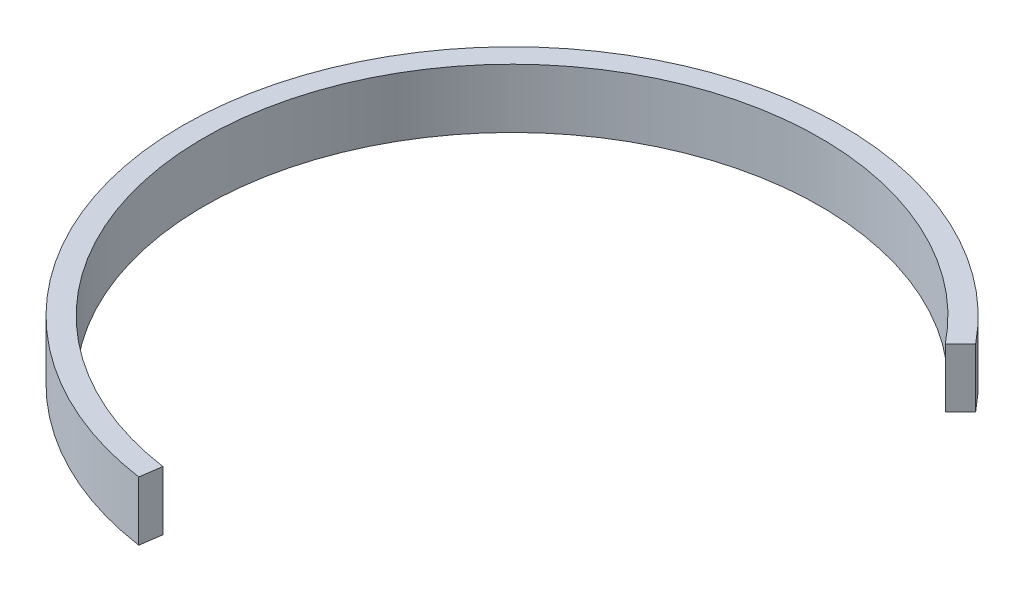
ISO-10303-21;
HEADER;
FILE_DESCRIPTION(('STEP AP214'),'2;1');
FILE_NAME('part.step','',(''),(''),'','','');
FILE_SCHEMA(('AUTOMOTIVE_DESIGN { 1 0 10303 214 1 1 1 1 }'));
ENDSEC;
DATA;
#1=APPLICATION_CONTEXT('core data for automotive mechanical design processes');
#2=APPLICATION_PROTOCOL_DEFINITION('international standard','automotive_design',2000,#1);
#3=PRODUCT_CONTEXT('',#1,'mechanical');
#4=PRODUCT('Part','Part','',(#3));
#5=PRODUCT_RELATED_PRODUCT_CATEGORY('part','',(#4));
#6=PRODUCT_DEFINITION_FORMATION('','',#4);
#7=PRODUCT_DEFINITION_CONTEXT('part definition',#1,'design');
#8=PRODUCT_DEFINITION('design','',#6,#7);
#9=PRODUCT_DEFINITION_SHAPE('','',#8);
#10=(LENGTH_UNIT() NAMED_UNIT(*) SI_UNIT(.MILLI.,.METRE.));
#11=(NAMED_UNIT(*) PLANE_ANGLE_UNIT() SI_UNIT($,.RADIAN.));
#12=(NAMED_UNIT(*) SI_UNIT($,.STERADIAN.) SOLID_ANGLE_UNIT());
#13=UNCERTAINTY_MEASURE_WITH_UNIT(LENGTH_MEASURE(1.E-05),#10,'distance_accuracy_value','');
#14=(GEOMETRIC_REPRESENTATION_CONTEXT(3) GLOBAL_UNCERTAINTY_ASSIGNED_CONTEXT((#13)) GLOBAL_UNIT_ASSIGNED_CONTEXT((#10,
#11,#12)) REPRESENTATION_CONTEXT('',''));
#15=CARTESIAN_POINT('',(0.,0.,0.));
#16=DIRECTION('',(0.,0.,1.));
#17=DIRECTION('',(1.,0.,0.));
#18=AXIS2_PLACEMENT_3D('',#15,#16,#17);
#19=CARTESIAN_POINT('',(145.719440182729,10.,-180.148984957569));
#20=DIRECTION('',(0.,-1.,0.));
#21=DIRECTION('',(0.,0.,-1.));
#22=AXIS2_PLACEMENT_3D('',#19,#20,#21);
#23=CYLINDRICAL_SURFACE('',#22,55.7524444730003);
#24=CARTESIAN_POINT('',(145.719440182729,0.,-180.148984957569));
#25=DIRECTION('',(0.,1.,0.));
#26=DIRECTION('',(0.,0.,1.));
#27=AXIS2_PLACEMENT_3D('',#24,#25,#26);
#28=CIRCLE('',#27,55.7524444730003);
#29=CARTESIAN_POINT('',(189.023006099054,0.,-215.265024649502));
#30=VERTEX_POINT('',#29);
#31=CARTESIAN_POINT('',(137.740061224364,0.,-124.970505673035));
#32=VERTEX_POINT('',#31);
#33=EDGE_CURVE('E93',#30,#32,#28,.T.);
#34=ORIENTED_EDGE('',*,*,#33,.T.);
#35=DIRECTION('',(0.,-1.,0.));
#36=VECTOR('',#35,1.);
#37=CARTESIAN_POINT('',(137.740061224364,10.,-124.970505673035));
#38=LINE('',#37,#36);
#39=CARTESIAN_POINT('',(137.740061224364,10.,-124.970505673035));
#40=VERTEX_POINT('',#39);
#41=EDGE_CURVE('E11',#40,#32,#38,.T.);
#42=ORIENTED_EDGE('',*,*,#41,.F.);
#43=CARTESIAN_POINT('',(145.719440182729,10.,-180.148984957569));
#44=DIRECTION('',(0.,1.,0.));
#45=DIRECTION('',(0.,0.,1.));
#46=AXIS2_PLACEMENT_3D('',#43,#44,#45);
#47=CIRCLE('',#46,55.7524444730003);
#48=CARTESIAN_POINT('',(189.023006099054,10.,-215.265024649502));
#49=VERTEX_POINT('',#48);
#50=EDGE_CURVE('E81',#49,#40,#47,.T.);
#51=ORIENTED_EDGE('',*,*,#50,.F.);
#52=DIRECTION('',(0.,-1.,0.));
#53=VECTOR('',#52,1.);
#54=CARTESIAN_POINT('',(189.023006099054,10.,-215.265024649502));
#55=LINE('',#54,#53);
#56=EDGE_CURVE('E89',#49,#30,#55,.T.);
#57=ORIENTED_EDGE('',*,*,#56,.T.);
#58=EDGE_LOOP('',(#34,#42,#51,#57));
#59=FACE_BOUND('',#58,.T.);
#60=ADVANCED_FACE('F30',(#59),#23,.T.);
#61=CARTESIAN_POINT('',(138.256458041574,10.,-128.541459155716));
#62=DIRECTION('',(-0.98970511169705,0.,-0.143121598232864));
#63=DIRECTION('',(-0.143121598232864,0.,0.98970511169705));
#64=AXIS2_PLACEMENT_3D('',#61,#62,#63);
#65=PLANE('',#64);
#66=DIRECTION('',(0.143121598232864,0.,-0.98970511169705));
#67=VECTOR('',#66,1.);
#68=CARTESIAN_POINT('',(138.256458041574,0.,-128.541459155716));
#69=LINE('',#68,#67);
#70=CARTESIAN_POINT('',(138.256458041574,0.,-128.541459155716));
#71=VERTEX_POINT('',#70);
#72=EDGE_CURVE('E85',#32,#71,#69,.T.);
#73=ORIENTED_EDGE('',*,*,#72,.T.);
#74=DIRECTION('',(0.,-1.,0.));
#75=VECTOR('',#74,1.);
#76=CARTESIAN_POINT('',(138.256458041574,10.,-128.541459155716));
#77=LINE('',#76,#75);
#78=CARTESIAN_POINT('',(138.256458041574,10.,-128.541459155716));
#79=VERTEX_POINT('',#78);
#80=EDGE_CURVE('E38',#79,#71,#77,.T.);
#81=ORIENTED_EDGE('',*,*,#80,.F.);
#82=DIRECTION('',(0.143121598232864,0.,-0.98970511169705));
#83=VECTOR('',#82,1.);
#84=CARTESIAN_POINT('',(138.256458041574,10.,-128.541459155716));
#85=LINE('',#84,#83);
#86=EDGE_CURVE('E76',#40,#79,#85,.T.);
#87=ORIENTED_EDGE('',*,*,#86,.F.);
#88=ORIENTED_EDGE('',*,*,#41,.T.);
#89=EDGE_LOOP('',(#73,#81,#87,#88));
#90=FACE_BOUND('',#89,.T.);
#91=ADVANCED_FACE('F84',(#90),#65,.F.);
#92=CARTESIAN_POINT('',(145.719440182729,10.,-180.148984957569));
#93=DIRECTION('',(0.,-1.,0.));
#94=DIRECTION('',(0.,0.,-1.));
#95=AXIS2_PLACEMENT_3D('',#92,#93,#94);
#96=CYLINDRICAL_SURFACE('',#95,52.1443460197569);
#97=CARTESIAN_POINT('',(145.719440182729,0.,-180.148984957569));
#98=DIRECTION('',(0.,-1.,0.));
#99=DIRECTION('',(0.,0.,1.));
#100=AXIS2_PLACEMENT_3D('',#97,#98,#99);
#101=CIRCLE('',#100,52.1443460197569);
#102=CARTESIAN_POINT('',(186.456859150957,0.,-212.698877701405));
#103=VERTEX_POINT('',#102);
#104=EDGE_CURVE('E63',#71,#103,#101,.T.);
#105=ORIENTED_EDGE('',*,*,#104,.T.);
#106=DIRECTION('',(0.,-1.,0.));
#107=VECTOR('',#106,1.);
#108=CARTESIAN_POINT('',(186.456859150957,10.,-212.698877701405));
#109=LINE('',#108,#107);
#110=CARTESIAN_POINT('',(186.456859150957,10.,-212.698877701405));
#111=VERTEX_POINT('',#110);
#112=EDGE_CURVE('E86',#111,#103,#109,.T.);
#113=ORIENTED_EDGE('',*,*,#112,.F.);
#114=CARTESIAN_POINT('',(145.719440182729,10.,-180.148984957569));
#115=DIRECTION('',(0.,-1.,0.));
#116=DIRECTION('',(0.,0.,1.));
#117=AXIS2_PLACEMENT_3D('',#114,#115,#116);
#118=CIRCLE('',#117,52.1443460197569);
#119=EDGE_CURVE('E79',#79,#111,#118,.T.);
#120=ORIENTED_EDGE('',*,*,#119,.F.);
#121=ORIENTED_EDGE('',*,*,#80,.T.);
#122=EDGE_LOOP('',(#105,#113,#120,#121));
#123=FACE_BOUND('',#122,.T.);
#124=ADVANCED_FACE('F87',(#123),#96,.F.);
#125=CARTESIAN_POINT('',(186.456859150957,10.,-212.698877701405));
#126=DIRECTION('',(-0.707106781186551,0.,-0.707106781186544));
#127=DIRECTION('',(-0.707106781186544,0.,0.707106781186551));
#128=AXIS2_PLACEMENT_3D('',#125,#126,#127);
#129=PLANE('',#128);
#130=DIRECTION('',(0.707106781186544,0.,-0.707106781186551));
#131=VECTOR('',#130,1.);
#132=CARTESIAN_POINT('',(186.456859150957,0.,-212.698877701405));
#133=LINE('',#132,#131);
#134=EDGE_CURVE('E69',#103,#30,#133,.T.);
#135=ORIENTED_EDGE('',*,*,#134,.T.);
#136=ORIENTED_EDGE('',*,*,#56,.F.);
#137=DIRECTION('',(0.707106781186544,0.,-0.707106781186551));
#138=VECTOR('',#137,1.);
#139=CARTESIAN_POINT('',(186.456859150957,10.,-212.698877701405));
#140=LINE('',#139,#138);
#141=EDGE_CURVE('E46',#111,#49,#140,.T.);
#142=ORIENTED_EDGE('',*,*,#141,.F.);
#143=ORIENTED_EDGE('',*,*,#112,.T.);
#144=EDGE_LOOP('',(#135,#136,#142,#143));
#145=FACE_BOUND('',#144,.T.);
#146=ADVANCED_FACE('F100',(#145),#129,.F.);
#147=CARTESIAN_POINT('',(145.719440182729,10.,-180.148984957569));
#148=DIRECTION('',(0.,1.,0.));
#149=DIRECTION('',(0.,0.,1.));
#150=AXIS2_PLACEMENT_3D('',#147,#148,#149);
#151=PLANE('',#150);
#152=ORIENTED_EDGE('',*,*,#50,.T.);
#153=ORIENTED_EDGE('',*,*,#86,.T.);
#154=ORIENTED_EDGE('',*,*,#119,.T.);
#155=ORIENTED_EDGE('',*,*,#141,.T.);
#156=EDGE_LOOP('',(#152,#153,#154,#155));
#157=FACE_BOUND('',#156,.T.);
#158=ADVANCED_FACE('F77',(#157),#151,.T.);
#159=CARTESIAN_POINT('',(145.719440182729,0.,-180.148984957569));
#160=DIRECTION('',(0.,1.,0.));
#161=DIRECTION('',(0.,0.,1.));
#162=AXIS2_PLACEMENT_3D('',#159,#160,#161);
#163=PLANE('',#162);
#164=ORIENTED_EDGE('',*,*,#33,.F.);
#165=ORIENTED_EDGE('',*,*,#134,.F.);
#166=ORIENTED_EDGE('',*,*,#104,.F.);
#167=ORIENTED_EDGE('',*,*,#72,.F.);
#168=EDGE_LOOP('',(#164,#165,#166,#167));
#169=FACE_BOUND('',#168,.T.);
#170=ADVANCED_FACE('F103',(#169),#163,.F.);
#171=CLOSED_SHELL('',(#60,#91,#124,#146,#158,#170));
#172=MANIFOLD_SOLID_BREP('B2',#171);
#173=ADVANCED_BREP_SHAPE_REPRESENTATION('',(#18,#172),#14);
#174=SHAPE_DEFINITION_REPRESENTATION(#9,#173);
ENDSEC;
END-ISO-10303-21;
